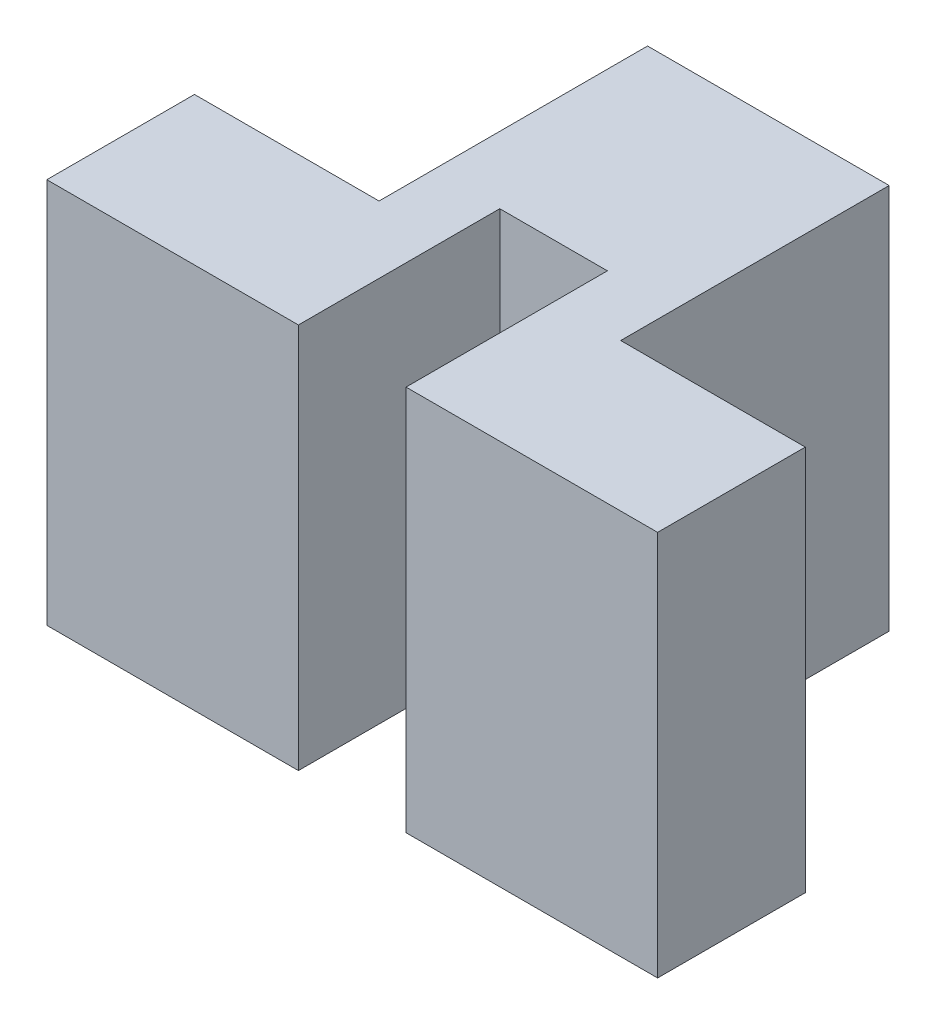
ISO-10303-21;
HEADER;
FILE_DESCRIPTION(('STEP AP214'),'2;1');
FILE_NAME('part.step','',(''),(''),'','','');
FILE_SCHEMA(('AUTOMOTIVE_DESIGN { 1 0 10303 214 1 1 1 1 }'));
ENDSEC;
DATA;
#1=APPLICATION_CONTEXT('core data for automotive mechanical design processes');
#2=APPLICATION_PROTOCOL_DEFINITION('international standard','automotive_design',2000,#1);
#3=PRODUCT_CONTEXT('',#1,'mechanical');
#4=PRODUCT('Part','Part','',(#3));
#5=PRODUCT_RELATED_PRODUCT_CATEGORY('part','',(#4));
#6=PRODUCT_DEFINITION_FORMATION('','',#4);
#7=PRODUCT_DEFINITION_CONTEXT('part definition',#1,'design');
#8=PRODUCT_DEFINITION('design','',#6,#7);
#9=PRODUCT_DEFINITION_SHAPE('','',#8);
#10=(LENGTH_UNIT() NAMED_UNIT(*) SI_UNIT(.MILLI.,.METRE.));
#11=(NAMED_UNIT(*) PLANE_ANGLE_UNIT() SI_UNIT($,.RADIAN.));
#12=(NAMED_UNIT(*) SI_UNIT($,.STERADIAN.) SOLID_ANGLE_UNIT());
#13=UNCERTAINTY_MEASURE_WITH_UNIT(LENGTH_MEASURE(1.E-05),#10,'distance_accuracy_value','');
#14=(GEOMETRIC_REPRESENTATION_CONTEXT(3) GLOBAL_UNCERTAINTY_ASSIGNED_CONTEXT((#13)) GLOBAL_UNIT_ASSIGNED_CONTEXT((#10,
#11,#12)) REPRESENTATION_CONTEXT('',''));
#15=CARTESIAN_POINT('',(0.,0.,0.));
#16=DIRECTION('',(0.,0.,1.));
#17=DIRECTION('',(1.,0.,0.));
#18=AXIS2_PLACEMENT_3D('',#15,#16,#17);
#19=CARTESIAN_POINT('',(0.,0.,2.2));
#20=DIRECTION('',(0.,0.,1.));
#21=DIRECTION('',(1.,0.,0.));
#22=AXIS2_PLACEMENT_3D('',#19,#20,#21);
#23=PLANE('',#22);
#24=DIRECTION('',(0.,-1.,0.));
#25=VECTOR('',#24,1.);
#26=CARTESIAN_POINT('',(-13.8516593096016,0.,2.2));
#27=LINE('',#26,#25);
#28=CARTESIAN_POINT('',(-13.8516593096016,14.25,2.2));
#29=VERTEX_POINT('',#28);
#30=CARTESIAN_POINT('',(-13.8516593096016,8.5,2.2));
#31=VERTEX_POINT('',#30);
#32=EDGE_CURVE('E41',#29,#31,#27,.T.);
#33=ORIENTED_EDGE('',*,*,#32,.F.);
#34=DIRECTION('',(-1.,0.,0.));
#35=VECTOR('',#34,1.);
#36=CARTESIAN_POINT('',(-8.50000000000001,14.25,2.2));
#37=LINE('',#36,#35);
#38=CARTESIAN_POINT('',(-17.6,14.25,2.2));
#39=VERTEX_POINT('',#38);
#40=EDGE_CURVE('E146',#29,#39,#37,.T.);
#41=ORIENTED_EDGE('',*,*,#40,.T.);
#42=DIRECTION('',(0.,-1.,0.));
#43=VECTOR('',#42,1.);
#44=CARTESIAN_POINT('',(-17.6,8.5,2.2));
#45=LINE('',#44,#43);
#46=CARTESIAN_POINT('',(-17.6,8.5,2.2));
#47=VERTEX_POINT('',#46);
#48=EDGE_CURVE('E145',#39,#47,#45,.T.);
#49=ORIENTED_EDGE('',*,*,#48,.T.);
#50=DIRECTION('',(1.,0.,0.));
#51=VECTOR('',#50,1.);
#52=CARTESIAN_POINT('',(-8.50000000000001,8.5,2.2));
#53=LINE('',#52,#51);
#54=EDGE_CURVE('E153',#47,#31,#53,.T.);
#55=ORIENTED_EDGE('',*,*,#54,.T.);
#56=EDGE_LOOP('',(#33,#41,#49,#55));
#57=FACE_BOUND('',#56,.T.);
#58=ADVANCED_FACE('F33',(#57),#23,.T.);
#59=CARTESIAN_POINT('',(0.,0.,0.));
#60=DIRECTION('',(0.,0.,1.));
#61=DIRECTION('',(1.,0.,0.));
#62=AXIS2_PLACEMENT_3D('',#59,#60,#61);
#63=PLANE('',#62);
#64=DIRECTION('',(0.,1.,0.));
#65=VECTOR('',#64,1.);
#66=CARTESIAN_POINT('',(-14.85,14.25,0.));
#67=LINE('',#66,#65);
#68=CARTESIAN_POINT('',(-14.85,8.5,0.));
#69=VERTEX_POINT('',#68);
#70=CARTESIAN_POINT('',(-14.85,14.25,0.));
#71=VERTEX_POINT('',#70);
#72=EDGE_CURVE('E200',#69,#71,#67,.T.);
#73=ORIENTED_EDGE('',*,*,#72,.F.);
#74=DIRECTION('',(1.,0.,0.));
#75=VECTOR('',#74,1.);
#76=CARTESIAN_POINT('',(-8.50000000000001,8.5,0.));
#77=LINE('',#76,#75);
#78=CARTESIAN_POINT('',(-17.6,8.5,0.));
#79=VERTEX_POINT('',#78);
#80=EDGE_CURVE('E167',#79,#69,#77,.T.);
#81=ORIENTED_EDGE('',*,*,#80,.F.);
#82=DIRECTION('',(0.,-1.,0.));
#83=VECTOR('',#82,1.);
#84=CARTESIAN_POINT('',(-17.6,8.5,0.));
#85=LINE('',#84,#83);
#86=CARTESIAN_POINT('',(-17.6,14.25,0.));
#87=VERTEX_POINT('',#86);
#88=EDGE_CURVE('E164',#87,#79,#85,.T.);
#89=ORIENTED_EDGE('',*,*,#88,.F.);
#90=DIRECTION('',(-1.,0.,0.));
#91=VECTOR('',#90,1.);
#92=CARTESIAN_POINT('',(-8.50000000000001,14.25,0.));
#93=LINE('',#92,#91);
#94=EDGE_CURVE('E56',#71,#87,#93,.T.);
#95=ORIENTED_EDGE('',*,*,#94,.F.);
#96=EDGE_LOOP('',(#73,#81,#89,#95));
#97=FACE_BOUND('',#96,.T.);
#98=ADVANCED_FACE('F198',(#97),#63,.F.);
#99=DIRECTION('',(0.,-1.,0.));
#100=VECTOR('',#99,1.);
#101=CARTESIAN_POINT('',(-11.25,14.25,0.));
#102=LINE('',#101,#100);
#103=CARTESIAN_POINT('',(-11.25,14.25,0.));
#104=VERTEX_POINT('',#103);
#105=CARTESIAN_POINT('',(-11.25,8.5,0.));
#106=VERTEX_POINT('',#105);
#107=EDGE_CURVE('E203',#104,#106,#102,.T.);
#108=ORIENTED_EDGE('',*,*,#107,.F.);
#109=CARTESIAN_POINT('',(-8.50000000000001,14.25,0.));
#110=VERTEX_POINT('',#109);
#111=EDGE_CURVE('E161',#110,#104,#93,.T.);
#112=ORIENTED_EDGE('',*,*,#111,.F.);
#113=DIRECTION('',(0.,1.,0.));
#114=VECTOR('',#113,1.);
#115=CARTESIAN_POINT('',(-8.50000000000001,8.5,0.));
#116=LINE('',#115,#114);
#117=CARTESIAN_POINT('',(-8.50000000000001,8.5,0.));
#118=VERTEX_POINT('',#117);
#119=EDGE_CURVE('E157',#118,#110,#116,.T.);
#120=ORIENTED_EDGE('',*,*,#119,.F.);
#121=EDGE_CURVE('E166',#106,#118,#77,.T.);
#122=ORIENTED_EDGE('',*,*,#121,.F.);
#123=EDGE_LOOP('',(#108,#112,#120,#122));
#124=FACE_BOUND('',#123,.T.);
#125=ADVANCED_FACE('F238',(#124),#63,.F.);
#126=CARTESIAN_POINT('',(-8.50000000000001,8.5,2.2));
#127=DIRECTION('',(-1.,0.,0.));
#128=DIRECTION('',(0.,0.,1.));
#129=AXIS2_PLACEMENT_3D('',#126,#127,#128);
#130=PLANE('',#129);
#131=ORIENTED_EDGE('',*,*,#119,.T.);
#132=DIRECTION('',(0.,0.,-1.));
#133=VECTOR('',#132,1.);
#134=CARTESIAN_POINT('',(-8.50000000000001,14.25,2.2));
#135=LINE('',#134,#133);
#136=CARTESIAN_POINT('',(-8.50000000000001,14.25,2.2));
#137=VERTEX_POINT('',#136);
#138=EDGE_CURVE('E128',#137,#110,#135,.T.);
#139=ORIENTED_EDGE('',*,*,#138,.F.);
#140=DIRECTION('',(0.,1.,0.));
#141=VECTOR('',#140,1.);
#142=CARTESIAN_POINT('',(-8.50000000000001,8.5,2.2));
#143=LINE('',#142,#141);
#144=CARTESIAN_POINT('',(-8.50000000000001,8.5,2.2));
#145=VERTEX_POINT('',#144);
#146=EDGE_CURVE('E143',#145,#137,#143,.T.);
#147=ORIENTED_EDGE('',*,*,#146,.F.);
#148=DIRECTION('',(0.,0.,-1.));
#149=VECTOR('',#148,1.);
#150=CARTESIAN_POINT('',(-8.50000000000001,8.5,2.2));
#151=LINE('',#150,#149);
#152=EDGE_CURVE('E156',#145,#118,#151,.T.);
#153=ORIENTED_EDGE('',*,*,#152,.T.);
#154=EDGE_LOOP('',(#131,#139,#147,#153));
#155=FACE_BOUND('',#154,.T.);
#156=ADVANCED_FACE('F35',(#155),#130,.F.);
#157=CARTESIAN_POINT('',(-8.50000000000001,14.25,2.2));
#158=DIRECTION('',(0.,-1.,0.));
#159=DIRECTION('',(0.,0.,-1.));
#160=AXIS2_PLACEMENT_3D('',#157,#158,#159);
#161=PLANE('',#160);
#162=ORIENTED_EDGE('',*,*,#40,.F.);
#163=DIRECTION('',(0.,0.,-1.));
#164=VECTOR('',#163,1.);
#165=CARTESIAN_POINT('',(-13.8516593096016,14.25,2.2));
#166=LINE('',#165,#164);
#167=CARTESIAN_POINT('',(-13.8516593096016,14.25,-0.8));
#168=VERTEX_POINT('',#167);
#169=EDGE_CURVE('E184',#29,#168,#166,.T.);
#170=ORIENTED_EDGE('',*,*,#169,.T.);
#171=DIRECTION('',(1.,0.,0.));
#172=VECTOR('',#171,1.);
#173=CARTESIAN_POINT('',(-8.50000000000001,14.25,-0.8));
#174=LINE('',#173,#172);
#175=CARTESIAN_POINT('',(-12.2483406903984,14.25,-0.8));
#176=VERTEX_POINT('',#175);
#177=EDGE_CURVE('E138',#168,#176,#174,.T.);
#178=ORIENTED_EDGE('',*,*,#177,.T.);
#179=DIRECTION('',(0.,0.,1.));
#180=VECTOR('',#179,1.);
#181=CARTESIAN_POINT('',(-12.2483406903984,14.25,2.2));
#182=LINE('',#181,#180);
#183=CARTESIAN_POINT('',(-12.2483406903984,14.25,2.2));
#184=VERTEX_POINT('',#183);
#185=EDGE_CURVE('E123',#176,#184,#182,.T.);
#186=ORIENTED_EDGE('',*,*,#185,.T.);
#187=EDGE_CURVE('E135',#137,#184,#37,.T.);
#188=ORIENTED_EDGE('',*,*,#187,.F.);
#189=ORIENTED_EDGE('',*,*,#138,.T.);
#190=ORIENTED_EDGE('',*,*,#111,.T.);
#191=DIRECTION('',(0.,0.,1.));
#192=VECTOR('',#191,1.);
#193=CARTESIAN_POINT('',(-11.25,14.25,-4.));
#194=LINE('',#193,#192);
#195=CARTESIAN_POINT('',(-11.25,14.25,-4.));
#196=VERTEX_POINT('',#195);
#197=EDGE_CURVE('E218',#196,#104,#194,.T.);
#198=ORIENTED_EDGE('',*,*,#197,.F.);
#199=DIRECTION('',(1.,0.,0.));
#200=VECTOR('',#199,1.);
#201=CARTESIAN_POINT('',(-14.85,14.25,-4.));
#202=LINE('',#201,#200);
#203=CARTESIAN_POINT('',(-14.85,14.25,-4.));
#204=VERTEX_POINT('',#203);
#205=EDGE_CURVE('E221',#204,#196,#202,.T.);
#206=ORIENTED_EDGE('',*,*,#205,.F.);
#207=DIRECTION('',(0.,0.,1.));
#208=VECTOR('',#207,1.);
#209=CARTESIAN_POINT('',(-14.85,14.25,-4.));
#210=LINE('',#209,#208);
#211=EDGE_CURVE('E160',#204,#71,#210,.T.);
#212=ORIENTED_EDGE('',*,*,#211,.T.);
#213=ORIENTED_EDGE('',*,*,#94,.T.);
#214=DIRECTION('',(0.,0.,-1.));
#215=VECTOR('',#214,1.);
#216=CARTESIAN_POINT('',(-17.6,14.25,2.2));
#217=LINE('',#216,#215);
#218=EDGE_CURVE('E175',#39,#87,#217,.T.);
#219=ORIENTED_EDGE('',*,*,#218,.F.);
#220=EDGE_LOOP('',(#162,#170,#178,#186,#188,#189,#190,#198,#206,#212,#213,#219));
#221=FACE_BOUND('',#220,.T.);
#222=ADVANCED_FACE('F133',(#221),#161,.F.);
#223=CARTESIAN_POINT('',(-17.6,8.5,2.2));
#224=DIRECTION('',(1.,0.,0.));
#225=DIRECTION('',(0.,0.,-1.));
#226=AXIS2_PLACEMENT_3D('',#223,#224,#225);
#227=PLANE('',#226);
#228=ORIENTED_EDGE('',*,*,#88,.T.);
#229=DIRECTION('',(0.,0.,-1.));
#230=VECTOR('',#229,1.);
#231=CARTESIAN_POINT('',(-17.6,8.5,2.2));
#232=LINE('',#231,#230);
#233=EDGE_CURVE('E172',#47,#79,#232,.T.);
#234=ORIENTED_EDGE('',*,*,#233,.F.);
#235=ORIENTED_EDGE('',*,*,#48,.F.);
#236=ORIENTED_EDGE('',*,*,#218,.T.);
#237=EDGE_LOOP('',(#228,#234,#235,#236));
#238=FACE_BOUND('',#237,.T.);
#239=ADVANCED_FACE('F194',(#238),#227,.F.);
#240=CARTESIAN_POINT('',(-8.50000000000001,8.5,2.2));
#241=DIRECTION('',(0.,1.,0.));
#242=DIRECTION('',(-1.,0.,0.));
#243=AXIS2_PLACEMENT_3D('',#240,#241,#242);
#244=PLANE('',#243);
#245=DIRECTION('',(-1.,0.,0.));
#246=VECTOR('',#245,1.);
#247=CARTESIAN_POINT('',(-8.50000000000001,8.5,-0.8));
#248=LINE('',#247,#246);
#249=CARTESIAN_POINT('',(-12.2483406903984,8.5,-0.8));
#250=VERTEX_POINT('',#249);
#251=CARTESIAN_POINT('',(-13.8516593096016,8.5,-0.8));
#252=VERTEX_POINT('',#251);
#253=EDGE_CURVE('E11',#250,#252,#248,.T.);
#254=ORIENTED_EDGE('',*,*,#253,.T.);
#255=DIRECTION('',(0.,0.,1.));
#256=VECTOR('',#255,1.);
#257=CARTESIAN_POINT('',(-13.8516593096016,8.5,2.2));
#258=LINE('',#257,#256);
#259=EDGE_CURVE('E139',#252,#31,#258,.T.);
#260=ORIENTED_EDGE('',*,*,#259,.T.);
#261=ORIENTED_EDGE('',*,*,#54,.F.);
#262=ORIENTED_EDGE('',*,*,#233,.T.);
#263=ORIENTED_EDGE('',*,*,#80,.T.);
#264=DIRECTION('',(0.,0.,1.));
#265=VECTOR('',#264,1.);
#266=CARTESIAN_POINT('',(-14.85,8.5,-4.));
#267=LINE('',#266,#265);
#268=CARTESIAN_POINT('',(-14.85,8.5,-4.));
#269=VERTEX_POINT('',#268);
#270=EDGE_CURVE('E213',#269,#69,#267,.T.);
#271=ORIENTED_EDGE('',*,*,#270,.F.);
#272=DIRECTION('',(-1.,0.,0.));
#273=VECTOR('',#272,1.);
#274=CARTESIAN_POINT('',(-14.85,8.5,-4.));
#275=LINE('',#274,#273);
#276=CARTESIAN_POINT('',(-11.25,8.5,-4.));
#277=VERTEX_POINT('',#276);
#278=EDGE_CURVE('E210',#277,#269,#275,.T.);
#279=ORIENTED_EDGE('',*,*,#278,.F.);
#280=DIRECTION('',(0.,0.,1.));
#281=VECTOR('',#280,1.);
#282=CARTESIAN_POINT('',(-11.25,8.5,-4.));
#283=LINE('',#282,#281);
#284=EDGE_CURVE('E215',#277,#106,#283,.T.);
#285=ORIENTED_EDGE('',*,*,#284,.T.);
#286=ORIENTED_EDGE('',*,*,#121,.T.);
#287=ORIENTED_EDGE('',*,*,#152,.F.);
#288=CARTESIAN_POINT('',(-12.2483406903984,8.5,2.2));
#289=VERTEX_POINT('',#288);
#290=EDGE_CURVE('E148',#289,#145,#53,.T.);
#291=ORIENTED_EDGE('',*,*,#290,.F.);
#292=DIRECTION('',(0.,0.,-1.));
#293=VECTOR('',#292,1.);
#294=CARTESIAN_POINT('',(-12.2483406903984,8.5,2.2));
#295=LINE('',#294,#293);
#296=EDGE_CURVE('E48',#289,#250,#295,.T.);
#297=ORIENTED_EDGE('',*,*,#296,.T.);
#298=EDGE_LOOP('',(#254,#260,#261,#262,#263,#271,#279,#285,#286,#287,#291,#297));
#299=FACE_BOUND('',#298,.T.);
#300=ADVANCED_FACE('F188',(#299),#244,.F.);
#301=DIRECTION('',(0.,1.,0.));
#302=VECTOR('',#301,1.);
#303=CARTESIAN_POINT('',(-12.2483406903984,0.,2.2));
#304=LINE('',#303,#302);
#305=EDGE_CURVE('E120',#289,#184,#304,.T.);
#306=ORIENTED_EDGE('',*,*,#305,.F.);
#307=ORIENTED_EDGE('',*,*,#290,.T.);
#308=ORIENTED_EDGE('',*,*,#146,.T.);
#309=ORIENTED_EDGE('',*,*,#187,.T.);
#310=EDGE_LOOP('',(#306,#307,#308,#309));
#311=FACE_BOUND('',#310,.T.);
#312=ADVANCED_FACE('F141',(#311),#23,.T.);
#313=CARTESIAN_POINT('',(-14.85,14.25,-4.));
#314=DIRECTION('',(1.,0.,0.));
#315=DIRECTION('',(0.,0.,-1.));
#316=AXIS2_PLACEMENT_3D('',#313,#314,#315);
#317=PLANE('',#316);
#318=ORIENTED_EDGE('',*,*,#72,.T.);
#319=ORIENTED_EDGE('',*,*,#211,.F.);
#320=DIRECTION('',(0.,1.,0.));
#321=VECTOR('',#320,1.);
#322=CARTESIAN_POINT('',(-14.85,14.25,-4.));
#323=LINE('',#322,#321);
#324=EDGE_CURVE('E206',#269,#204,#323,.T.);
#325=ORIENTED_EDGE('',*,*,#324,.F.);
#326=ORIENTED_EDGE('',*,*,#270,.T.);
#327=EDGE_LOOP('',(#318,#319,#325,#326));
#328=FACE_BOUND('',#327,.T.);
#329=ADVANCED_FACE('F224',(#328),#317,.F.);
#330=CARTESIAN_POINT('',(-11.25,14.25,-4.));
#331=DIRECTION('',(-1.,0.,0.));
#332=DIRECTION('',(0.,0.,1.));
#333=AXIS2_PLACEMENT_3D('',#330,#331,#332);
#334=PLANE('',#333);
#335=ORIENTED_EDGE('',*,*,#107,.T.);
#336=ORIENTED_EDGE('',*,*,#284,.F.);
#337=DIRECTION('',(0.,-1.,0.));
#338=VECTOR('',#337,1.);
#339=CARTESIAN_POINT('',(-11.25,14.25,-4.));
#340=LINE('',#339,#338);
#341=EDGE_CURVE('E227',#196,#277,#340,.T.);
#342=ORIENTED_EDGE('',*,*,#341,.F.);
#343=ORIENTED_EDGE('',*,*,#197,.T.);
#344=EDGE_LOOP('',(#335,#336,#342,#343));
#345=FACE_BOUND('',#344,.T.);
#346=ADVANCED_FACE('F236',(#345),#334,.F.);
#347=CARTESIAN_POINT('',(0.,0.,-4.));
#348=DIRECTION('',(0.,0.,1.));
#349=DIRECTION('',(1.,0.,0.));
#350=AXIS2_PLACEMENT_3D('',#347,#348,#349);
#351=PLANE('',#350);
#352=ORIENTED_EDGE('',*,*,#324,.T.);
#353=ORIENTED_EDGE('',*,*,#205,.T.);
#354=ORIENTED_EDGE('',*,*,#341,.T.);
#355=ORIENTED_EDGE('',*,*,#278,.T.);
#356=EDGE_LOOP('',(#352,#353,#354,#355));
#357=FACE_BOUND('',#356,.T.);
#358=ADVANCED_FACE('F233',(#357),#351,.F.);
#359=CARTESIAN_POINT('',(0.,0.,-0.8));
#360=DIRECTION('',(0.,0.,-1.));
#361=DIRECTION('',(-1.,0.,0.));
#362=AXIS2_PLACEMENT_3D('',#359,#360,#361);
#363=PLANE('',#362);
#364=DIRECTION('',(0.,-1.,0.));
#365=VECTOR('',#364,1.);
#366=CARTESIAN_POINT('',(-13.8516593096016,3.875,-0.8));
#367=LINE('',#366,#365);
#368=EDGE_CURVE('E243',#168,#252,#367,.T.);
#369=ORIENTED_EDGE('',*,*,#368,.T.);
#370=ORIENTED_EDGE('',*,*,#253,.F.);
#371=DIRECTION('',(0.,1.,0.));
#372=VECTOR('',#371,1.);
#373=CARTESIAN_POINT('',(-12.2483406903984,3.875,-0.8));
#374=LINE('',#373,#372);
#375=EDGE_CURVE('E241',#250,#176,#374,.T.);
#376=ORIENTED_EDGE('',*,*,#375,.T.);
#377=ORIENTED_EDGE('',*,*,#177,.F.);
#378=EDGE_LOOP('',(#369,#370,#376,#377));
#379=FACE_BOUND('',#378,.T.);
#380=ADVANCED_FACE('F247',(#379),#363,.F.);
#381=CARTESIAN_POINT('',(-13.8516593096016,3.875,-0.8));
#382=DIRECTION('',(-1.,0.,0.));
#383=DIRECTION('',(0.,0.,1.));
#384=AXIS2_PLACEMENT_3D('',#381,#382,#383);
#385=PLANE('',#384);
#386=ORIENTED_EDGE('',*,*,#32,.T.);
#387=ORIENTED_EDGE('',*,*,#259,.F.);
#388=ORIENTED_EDGE('',*,*,#368,.F.);
#389=ORIENTED_EDGE('',*,*,#169,.F.);
#390=EDGE_LOOP('',(#386,#387,#388,#389));
#391=FACE_BOUND('',#390,.T.);
#392=ADVANCED_FACE('F181',(#391),#385,.F.);
#393=CARTESIAN_POINT('',(-12.2483406903984,3.875,-0.8));
#394=DIRECTION('',(1.,0.,0.));
#395=DIRECTION('',(0.,0.,-1.));
#396=AXIS2_PLACEMENT_3D('',#393,#394,#395);
#397=PLANE('',#396);
#398=ORIENTED_EDGE('',*,*,#375,.F.);
#399=ORIENTED_EDGE('',*,*,#296,.F.);
#400=ORIENTED_EDGE('',*,*,#305,.T.);
#401=ORIENTED_EDGE('',*,*,#185,.F.);
#402=EDGE_LOOP('',(#398,#399,#400,#401));
#403=FACE_BOUND('',#402,.T.);
#404=ADVANCED_FACE('F122',(#403),#397,.F.);
#405=CLOSED_SHELL('',(#58,#98,#125,#156,#222,#239,#300,#312,#329,#346,#358,#380,#392,#404));
#406=MANIFOLD_SOLID_BREP('B2',#405);
#407=ADVANCED_BREP_SHAPE_REPRESENTATION('',(#18,#406),#14);
#408=SHAPE_DEFINITION_REPRESENTATION(#9,#407);
ENDSEC;
END-ISO-10303-21;
